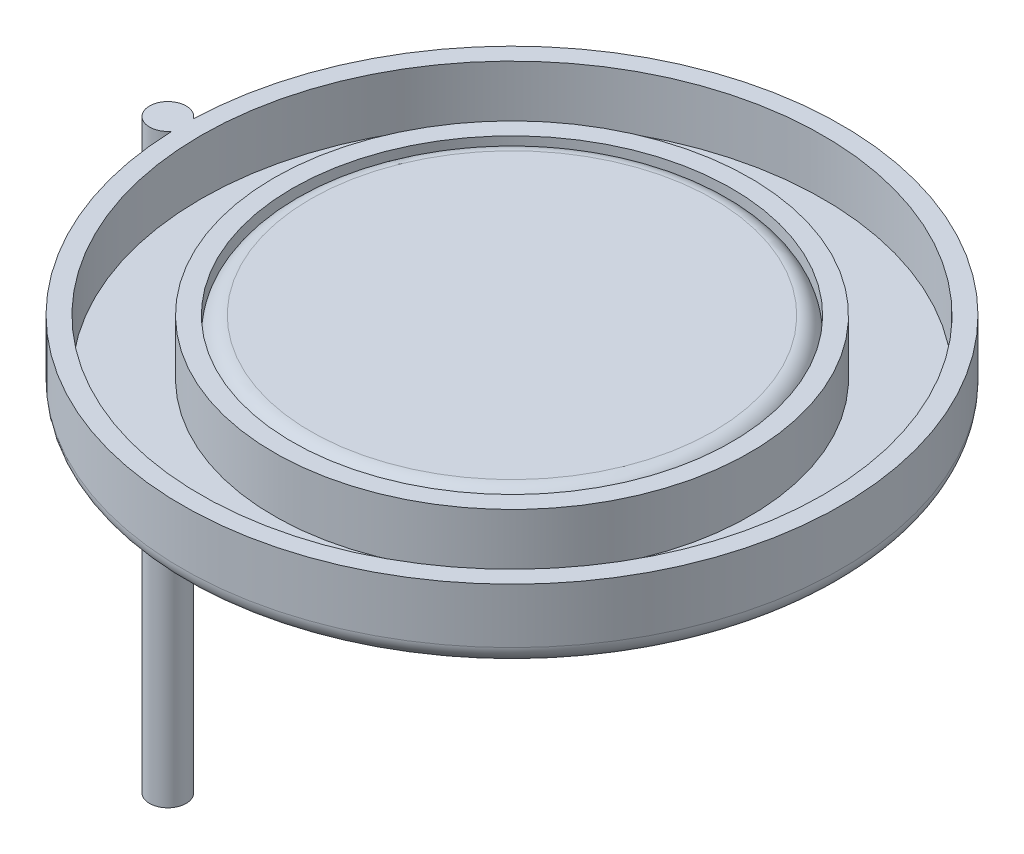
ISO-10303-21;
HEADER;
FILE_DESCRIPTION(('STEP AP214'),'2;1');
FILE_NAME('part.step','',(''),(''),'','','');
FILE_SCHEMA(('AUTOMOTIVE_DESIGN { 1 0 10303 214 1 1 1 1 }'));
ENDSEC;
DATA;
#1=APPLICATION_CONTEXT('core data for automotive mechanical design processes');
#2=APPLICATION_PROTOCOL_DEFINITION('international standard','automotive_design',2000,#1);
#3=PRODUCT_CONTEXT('',#1,'mechanical');
#4=PRODUCT('Part','Part','',(#3));
#5=PRODUCT_RELATED_PRODUCT_CATEGORY('part','',(#4));
#6=PRODUCT_DEFINITION_FORMATION('','',#4);
#7=PRODUCT_DEFINITION_CONTEXT('part definition',#1,'design');
#8=PRODUCT_DEFINITION('design','',#6,#7);
#9=PRODUCT_DEFINITION_SHAPE('','',#8);
#10=(LENGTH_UNIT() NAMED_UNIT(*) SI_UNIT(.MILLI.,.METRE.));
#11=(NAMED_UNIT(*) PLANE_ANGLE_UNIT() SI_UNIT($,.RADIAN.));
#12=(NAMED_UNIT(*) SI_UNIT($,.STERADIAN.) SOLID_ANGLE_UNIT());
#13=UNCERTAINTY_MEASURE_WITH_UNIT(LENGTH_MEASURE(1.E-05),#10,'distance_accuracy_value','');
#14=(GEOMETRIC_REPRESENTATION_CONTEXT(3) GLOBAL_UNCERTAINTY_ASSIGNED_CONTEXT((#13)) GLOBAL_UNIT_ASSIGNED_CONTEXT((#10,
#11,#12)) REPRESENTATION_CONTEXT('',''));
#15=CARTESIAN_POINT('',(0.,0.,0.));
#16=DIRECTION('',(0.,0.,1.));
#17=DIRECTION('',(1.,0.,0.));
#18=AXIS2_PLACEMENT_3D('',#15,#16,#17);
#19=CARTESIAN_POINT('',(0.,1.05,0.));
#20=DIRECTION('',(0.,1.,0.));
#21=DIRECTION('',(-1.,0.,0.));
#22=AXIS2_PLACEMENT_3D('',#19,#20,#21);
#23=CYLINDRICAL_SURFACE('',#22,3.);
#24=CARTESIAN_POINT('',(0.,0.999999999999999,0.));
#25=DIRECTION('',(0.,1.,0.));
#26=DIRECTION('',(-1.,0.,0.));
#27=AXIS2_PLACEMENT_3D('',#24,#25,#26);
#28=CIRCLE('',#27,3.);
#29=CARTESIAN_POINT('',(-3.,1.,0.));
#30=VERTEX_POINT('',#29);
#31=EDGE_CURVE('E94',#30,#30,#28,.T.);
#32=ORIENTED_EDGE('',*,*,#31,.T.);
#33=EDGE_LOOP('',(#32));
#34=FACE_BOUND('',#33,.T.);
#35=CARTESIAN_POINT('',(0.,0.75,0.));
#36=DIRECTION('',(0.,-1.,0.));
#37=DIRECTION('',(1.,0.,0.));
#38=AXIS2_PLACEMENT_3D('',#35,#36,#37);
#39=CIRCLE('',#38,3.);
#40=CARTESIAN_POINT('',(3.,0.75,0.));
#41=VERTEX_POINT('',#40);
#42=EDGE_CURVE('E286',#41,#41,#39,.T.);
#43=ORIENTED_EDGE('',*,*,#42,.T.);
#44=EDGE_LOOP('',(#43));
#45=FACE_BOUND('',#44,.T.);
#46=ADVANCED_FACE('F32',(#34,#45),#23,.F.);
#47=CARTESIAN_POINT('',(-4.7,-7.,0.));
#48=DIRECTION('',(0.,1.,0.));
#49=DIRECTION('',(-1.,0.,0.));
#50=AXIS2_PLACEMENT_3D('',#47,#48,#49);
#51=CYLINDRICAL_SURFACE('',#50,0.25);
#52=DIRECTION('',(0.,1.,0.));
#53=VECTOR('',#52,1.);
#54=CARTESIAN_POINT('',(-4.49760638297872,0.625,-0.146754297344388));
#55=LINE('',#54,#53);
#56=CARTESIAN_POINT('',(-4.49760638297872,0.25,-0.146754297344388));
#57=VERTEX_POINT('',#56);
#58=CARTESIAN_POINT('',(-4.49760638297872,1.,-0.146754297344388));
#59=VERTEX_POINT('',#58);
#60=EDGE_CURVE('E60',#57,#59,#55,.T.);
#61=ORIENTED_EDGE('',*,*,#60,.F.);
#62=CARTESIAN_POINT('',(-4.49760630638297,0.2502,0.146754191708636));
#63=CARTESIAN_POINT('',(-4.49762410202563,0.241930948862253,0.14675955146571));
#64=CARTESIAN_POINT('',(-4.49722663321649,0.233658933576919,0.146230014571357));
#65=CARTESIAN_POINT('',(-4.49568006883129,0.217319938522348,0.144071640543252));
#66=CARTESIAN_POINT('',(-4.4945299259303,0.20925326074727,0.142441271531871));
#67=CARTESIAN_POINT('',(-4.49155519513391,0.193549037815725,0.138048428377494));
#68=CARTESIAN_POINT('',(-4.48972964945597,0.185912119902879,0.135284345918194));
#69=CARTESIAN_POINT('',(-4.48557558234056,0.17131860765148,0.128598877003869));
#70=CARTESIAN_POINT('',(-4.48324759446005,0.164361302911009,0.124678716613543));
#71=CARTESIAN_POINT('',(-4.47836121673525,0.151439031337531,0.115764991181218));
#72=CARTESIAN_POINT('',(-4.47580705428886,0.145460107428513,0.110789387751526));
#73=CARTESIAN_POINT('',(-4.47070827083454,0.13452929133629,0.0998089268948837));
#74=CARTESIAN_POINT('',(-4.46816365017578,0.129577436386102,0.0938040321687606));
#75=CARTESIAN_POINT('',(-4.46346389959384,0.120993587018328,0.0812026545558668));
#76=CARTESIAN_POINT('',(-4.46129662962509,0.117313483948165,0.0746433498620404));
#77=CARTESIAN_POINT('',(-4.45742801217928,0.111013878055508,0.0609074878288262));
#78=CARTESIAN_POINT('',(-4.45572669984212,0.108394455216407,0.0537308839898221));
#79=CARTESIAN_POINT('',(-4.45293109441321,0.104194906463015,0.038912732145378));
#80=CARTESIAN_POINT('',(-4.4518410846646,0.10262210013598,0.0312683096341471));
#81=CARTESIAN_POINT('',(-4.45037636964013,0.10052585170435,0.0157693052565196));
#82=CARTESIAN_POINT('',(-4.45000181517096,0.100002630834661,0.00791467943629636));
#83=CARTESIAN_POINT('',(-4.44999814653398,0.0999973130742638,-0.00802356277860808));
#84=CARTESIAN_POINT('',(-4.4503909433348,0.10054581835986,-0.0161072205920081));
#85=CARTESIAN_POINT('',(-4.45193334731891,0.102755089900064,-0.0320476164276199));
#86=CARTESIAN_POINT('',(-4.45308293713906,0.104415830636637,-0.0399043596516228));
#87=CARTESIAN_POINT('',(-4.45603943680495,0.108872565523693,-0.0551701178883071));
#88=CARTESIAN_POINT('',(-4.45784706635036,0.111669803053877,-0.0625786322861057));
#89=CARTESIAN_POINT('',(-4.46194620752408,0.118405419197658,-0.0767106358352226));
#90=CARTESIAN_POINT('',(-4.46423758061989,0.122343471229411,-0.0834343202898465));
#91=CARTESIAN_POINT('',(-4.46899948883797,0.131193018337334,-0.0958207985261037));
#92=CARTESIAN_POINT('',(-4.47146308903941,0.136073696815364,-0.101508295451171));
#93=CARTESIAN_POINT('',(-4.47637623038614,0.146776635020957,-0.111917849220896));
#94=CARTESIAN_POINT('',(-4.47882577505019,0.152598647393039,-0.116640158952936));
#95=CARTESIAN_POINT('',(-4.48345089852349,0.16497871544306,-0.125017220482105));
#96=CARTESIAN_POINT('',(-4.48562866830138,0.171529952662846,-0.128680872244827));
#97=CARTESIAN_POINT('',(-4.48954349131381,0.185234033204647,-0.134988061985459));
#98=CARTESIAN_POINT('',(-4.49128009797401,0.192387476446871,-0.137630567690722));
#99=CARTESIAN_POINT('',(-4.49430906338326,0.207831493807149,-0.142126150227152));
#100=CARTESIAN_POINT('',(-4.49554022441958,0.216164462884364,-0.143874846815892));
#101=CARTESIAN_POINT('',(-4.49719870086938,0.23306664782491,-0.146191385241015));
#102=CARTESIAN_POINT('',(-4.49762646695095,0.241635728501194,-0.146759889130757));
#103=CARTESIAN_POINT('',(-4.49760630638297,0.250199999999983,-0.146754191708693));
#104=B_SPLINE_CURVE_WITH_KNOTS('',3,(#62,#63,#64,#65,#66,#67,#68,#69,#70,#71,#72,#73,#74,#75,
#76,#77,#78,#79,#80,#81,#82,#83,#84,#85,#86,#87,#88,#89,#90,#91,#92,#93,#94,#95,#96,#97,#98,#99,
#100,#101,#102,#103),.UNSPECIFIED.,.F.,.F.,(4,2,2,2,2,2,2,2,2,2,2,2,2,2,2,2,2,2,2,2,4),(0.,
0.0247836060695387,0.0496017713696941,0.074455266832717,0.0992824984286643,0.123716978920959,
0.148152345050434,0.171522989171247,0.194895395289112,0.218429586651436,0.241968738103186,
0.266189856028938,0.290410418268241,0.314657550576807,0.338897748487901,0.362449635329038,
0.385995343439517,0.40933692915298,0.432702049442135,0.458386144744586,0.484055828128045),.UNSPECIFIED.);
#105=CARTESIAN_POINT('',(-4.49760638297872,0.25,0.146754297344444));
#106=VERTEX_POINT('',#105);
#107=EDGE_CURVE('E11',#106,#57,#104,.T.);
#108=ORIENTED_EDGE('',*,*,#107,.F.);
#109=DIRECTION('',(0.,1.,0.));
#110=VECTOR('',#109,1.);
#111=CARTESIAN_POINT('',(-4.49760638297872,0.625,0.146754297344388));
#112=LINE('',#111,#110);
#113=CARTESIAN_POINT('',(-4.49760638297872,1.,0.146754297344388));
#114=VERTEX_POINT('',#113);
#115=EDGE_CURVE('E66',#114,#106,#112,.F.);
#116=ORIENTED_EDGE('',*,*,#115,.F.);
#117=CARTESIAN_POINT('',(-4.7,1.,0.));
#118=DIRECTION('',(0.,1.,0.));
#119=DIRECTION('',(-1.,0.,0.));
#120=AXIS2_PLACEMENT_3D('',#117,#118,#119);
#121=CIRCLE('',#120,0.25);
#122=EDGE_CURVE('E55',#59,#114,#121,.T.);
#123=ORIENTED_EDGE('',*,*,#122,.F.);
#124=EDGE_LOOP('',(#61,#108,#116,#123));
#125=FACE_BOUND('',#124,.T.);
#126=CARTESIAN_POINT('',(-4.7,-7.,0.));
#127=DIRECTION('',(0.,1.,0.));
#128=DIRECTION('',(-1.,0.,0.));
#129=AXIS2_PLACEMENT_3D('',#126,#127,#128);
#130=CIRCLE('',#129,0.25);
#131=CARTESIAN_POINT('',(-4.95,-7.,0.));
#132=VERTEX_POINT('',#131);
#133=EDGE_CURVE('E45',#132,#132,#130,.T.);
#134=ORIENTED_EDGE('',*,*,#133,.T.);
#135=EDGE_LOOP('',(#134));
#136=FACE_BOUND('',#135,.T.);
#137=ADVANCED_FACE('F34',(#125,#136),#51,.T.);
#138=CARTESIAN_POINT('',(-4.7,-7.,0.));
#139=DIRECTION('',(0.,1.,0.));
#140=DIRECTION('',(-1.,0.,0.));
#141=AXIS2_PLACEMENT_3D('',#138,#139,#140);
#142=PLANE('',#141);
#143=ORIENTED_EDGE('',*,*,#133,.F.);
#144=EDGE_LOOP('',(#143));
#145=FACE_BOUND('',#144,.T.);
#146=ADVANCED_FACE('F104',(#145),#142,.F.);
#147=CARTESIAN_POINT('',(-4.7,1.,0.));
#148=DIRECTION('',(0.,1.,0.));
#149=DIRECTION('',(-1.,0.,0.));
#150=AXIS2_PLACEMENT_3D('',#147,#148,#149);
#151=PLANE('',#150);
#152=ORIENTED_EDGE('',*,*,#122,.T.);
#153=CARTESIAN_POINT('',(0.,0.999999999999999,0.));
#154=DIRECTION('',(0.,1.,0.));
#155=DIRECTION('',(-1.,0.,0.));
#156=AXIS2_PLACEMENT_3D('',#153,#154,#155);
#157=CIRCLE('',#156,4.5);
#158=EDGE_CURVE('E73',#114,#59,#157,.T.);
#159=ORIENTED_EDGE('',*,*,#158,.T.);
#160=EDGE_LOOP('',(#152,#159));
#161=FACE_BOUND('',#160,.T.);
#162=CARTESIAN_POINT('',(0.,0.999999999999999,0.));
#163=DIRECTION('',(0.,1.,0.));
#164=DIRECTION('',(-1.,0.,0.));
#165=AXIS2_PLACEMENT_3D('',#162,#163,#164);
#166=CIRCLE('',#165,4.25);
#167=CARTESIAN_POINT('',(-4.25,1.,0.));
#168=VERTEX_POINT('',#167);
#169=EDGE_CURVE('E76',#168,#168,#166,.T.);
#170=ORIENTED_EDGE('',*,*,#169,.F.);
#171=EDGE_LOOP('',(#170));
#172=FACE_BOUND('',#171,.T.);
#173=ADVANCED_FACE('F100',(#161,#172),#151,.T.);
#174=CARTESIAN_POINT('',(-3.25,1.,0.));
#175=DIRECTION('',(0.,-1.,0.));
#176=DIRECTION('',(1.,0.,0.));
#177=AXIS2_PLACEMENT_3D('',#174,#175,#176);
#178=PLANE('',#177);
#179=ORIENTED_EDGE('',*,*,#31,.F.);
#180=EDGE_LOOP('',(#179));
#181=FACE_BOUND('',#180,.T.);
#182=CARTESIAN_POINT('',(0.,0.999999999999999,0.));
#183=DIRECTION('',(0.,1.,0.));
#184=DIRECTION('',(-1.,0.,0.));
#185=AXIS2_PLACEMENT_3D('',#182,#183,#184);
#186=CIRCLE('',#185,3.25);
#187=CARTESIAN_POINT('',(-3.25,1.,0.));
#188=VERTEX_POINT('',#187);
#189=EDGE_CURVE('E91',#188,#188,#186,.T.);
#190=ORIENTED_EDGE('',*,*,#189,.T.);
#191=EDGE_LOOP('',(#190));
#192=FACE_BOUND('',#191,.T.);
#193=ADVANCED_FACE('F103',(#181,#192),#178,.F.);
#194=CARTESIAN_POINT('',(0.,1.05,0.));
#195=DIRECTION('',(0.,1.,0.));
#196=DIRECTION('',(-1.,0.,0.));
#197=AXIS2_PLACEMENT_3D('',#194,#195,#196);
#198=CYLINDRICAL_SURFACE('',#197,3.25);
#199=ORIENTED_EDGE('',*,*,#189,.F.);
#200=EDGE_LOOP('',(#199));
#201=FACE_BOUND('',#200,.T.);
#202=CARTESIAN_POINT('',(0.,0.249999999999999,0.));
#203=DIRECTION('',(0.,1.,0.));
#204=DIRECTION('',(-1.,0.,0.));
#205=AXIS2_PLACEMENT_3D('',#202,#203,#204);
#206=CIRCLE('',#205,3.25);
#207=CARTESIAN_POINT('',(-3.25,0.25,0.));
#208=VERTEX_POINT('',#207);
#209=EDGE_CURVE('E88',#208,#208,#206,.T.);
#210=ORIENTED_EDGE('',*,*,#209,.T.);
#211=EDGE_LOOP('',(#210));
#212=FACE_BOUND('',#211,.T.);
#213=ADVANCED_FACE('F117',(#201,#212),#198,.T.);
#214=CARTESIAN_POINT('',(-4.25,0.25,0.));
#215=DIRECTION('',(0.,-1.,0.));
#216=DIRECTION('',(1.,0.,0.));
#217=AXIS2_PLACEMENT_3D('',#214,#215,#216);
#218=PLANE('',#217);
#219=ORIENTED_EDGE('',*,*,#209,.F.);
#220=EDGE_LOOP('',(#219));
#221=FACE_BOUND('',#220,.T.);
#222=CARTESIAN_POINT('',(0.,0.249999999999999,0.));
#223=DIRECTION('',(0.,1.,0.));
#224=DIRECTION('',(-1.,0.,0.));
#225=AXIS2_PLACEMENT_3D('',#222,#223,#224);
#226=CIRCLE('',#225,4.25);
#227=CARTESIAN_POINT('',(-4.25,0.25,0.));
#228=VERTEX_POINT('',#227);
#229=EDGE_CURVE('E85',#228,#228,#226,.T.);
#230=ORIENTED_EDGE('',*,*,#229,.T.);
#231=EDGE_LOOP('',(#230));
#232=FACE_BOUND('',#231,.T.);
#233=ADVANCED_FACE('F109',(#221,#232),#218,.F.);
#234=CARTESIAN_POINT('',(0.,1.05,0.));
#235=DIRECTION('',(0.,1.,0.));
#236=DIRECTION('',(-1.,0.,0.));
#237=AXIS2_PLACEMENT_3D('',#234,#235,#236);
#238=CYLINDRICAL_SURFACE('',#237,4.25);
#239=ORIENTED_EDGE('',*,*,#229,.F.);
#240=EDGE_LOOP('',(#239));
#241=FACE_BOUND('',#240,.T.);
#242=ORIENTED_EDGE('',*,*,#169,.T.);
#243=EDGE_LOOP('',(#242));
#244=FACE_BOUND('',#243,.T.);
#245=ADVANCED_FACE('F107',(#241,#244),#238,.F.);
#246=CARTESIAN_POINT('',(0.,1.05,0.));
#247=DIRECTION('',(0.,1.,0.));
#248=DIRECTION('',(-1.,0.,0.));
#249=AXIS2_PLACEMENT_3D('',#246,#247,#248);
#250=CYLINDRICAL_SURFACE('',#249,4.5);
#251=CARTESIAN_POINT('',(0.,0.249999999999999,0.));
#252=DIRECTION('',(0.,1.,0.));
#253=DIRECTION('',(-1.,0.,0.));
#254=AXIS2_PLACEMENT_3D('',#251,#252,#253);
#255=CIRCLE('',#254,4.5);
#256=EDGE_CURVE('E71',#106,#57,#255,.T.);
#257=ORIENTED_EDGE('',*,*,#256,.T.);
#258=ORIENTED_EDGE('',*,*,#60,.T.);
#259=ORIENTED_EDGE('',*,*,#158,.F.);
#260=ORIENTED_EDGE('',*,*,#115,.T.);
#261=EDGE_LOOP('',(#257,#258,#259,#260));
#262=FACE_BOUND('',#261,.T.);
#263=ADVANCED_FACE('F72',(#262),#250,.T.);
#264=CARTESIAN_POINT('',(0.,0.249999999999999,0.));
#265=DIRECTION('',(0.,1.,0.));
#266=DIRECTION('',(-1.,0.,0.));
#267=AXIS2_PLACEMENT_3D('',#264,#265,#266);
#268=TOROIDAL_SURFACE('',#267,4.25,0.25);
#269=CARTESIAN_POINT('',(0.,0.,0.));
#270=DIRECTION('',(0.,1.,0.));
#271=DIRECTION('',(-1.,0.,0.));
#272=AXIS2_PLACEMENT_3D('',#269,#270,#271);
#273=CIRCLE('',#272,4.25);
#274=CARTESIAN_POINT('',(-4.25,0.,0.));
#275=VERTEX_POINT('',#274);
#276=EDGE_CURVE('E74',#275,#275,#273,.T.);
#277=ORIENTED_EDGE('',*,*,#276,.T.);
#278=EDGE_LOOP('',(#277));
#279=FACE_BOUND('',#278,.T.);
#280=ORIENTED_EDGE('',*,*,#256,.F.);
#281=ORIENTED_EDGE('',*,*,#107,.T.);
#282=EDGE_LOOP('',(#280,#281));
#283=FACE_BOUND('',#282,.T.);
#284=ADVANCED_FACE('F70',(#279,#283),#268,.T.);
#285=CARTESIAN_POINT('',(-4.25,0.,0.));
#286=DIRECTION('',(0.,-1.,0.));
#287=DIRECTION('',(1.,0.,0.));
#288=AXIS2_PLACEMENT_3D('',#285,#286,#287);
#289=PLANE('',#288);
#290=CARTESIAN_POINT('',(0.,0.,0.));
#291=DIRECTION('',(0.,1.,0.));
#292=DIRECTION('',(-1.,0.,0.));
#293=AXIS2_PLACEMENT_3D('',#290,#291,#292);
#294=CIRCLE('',#293,3.25);
#295=CARTESIAN_POINT('',(-3.25,0.,0.));
#296=VERTEX_POINT('',#295);
#297=EDGE_CURVE('E79',#296,#296,#294,.T.);
#298=ORIENTED_EDGE('',*,*,#297,.T.);
#299=EDGE_LOOP('',(#298));
#300=FACE_BOUND('',#299,.T.);
#301=ORIENTED_EDGE('',*,*,#276,.F.);
#302=EDGE_LOOP('',(#301));
#303=FACE_BOUND('',#302,.T.);
#304=ADVANCED_FACE('F177',(#300,#303),#289,.T.);
#305=CARTESIAN_POINT('',(0.,0.249999999999999,0.));
#306=DIRECTION('',(0.,1.,0.));
#307=DIRECTION('',(-1.,0.,0.));
#308=AXIS2_PLACEMENT_3D('',#305,#306,#307);
#309=TOROIDAL_SURFACE('',#308,3.25,0.25);
#310=CARTESIAN_POINT('',(0.,0.249999999999999,0.));
#311=DIRECTION('',(0.,-1.,0.));
#312=DIRECTION('',(1.,0.,0.));
#313=AXIS2_PLACEMENT_3D('',#310,#311,#312);
#314=CIRCLE('',#313,3.);
#315=CARTESIAN_POINT('',(3.,0.249999999999999,0.));
#316=VERTEX_POINT('',#315);
#317=EDGE_CURVE('E299',#316,#316,#314,.F.);
#318=ORIENTED_EDGE('',*,*,#317,.T.);
#319=EDGE_LOOP('',(#318));
#320=FACE_BOUND('',#319,.T.);
#321=ORIENTED_EDGE('',*,*,#297,.F.);
#322=EDGE_LOOP('',(#321));
#323=FACE_BOUND('',#322,.T.);
#324=ADVANCED_FACE('F186',(#320,#323),#309,.T.);
#325=CARTESIAN_POINT('',(3.,0.,0.));
#326=DIRECTION('',(0.,1.,0.));
#327=DIRECTION('',(-1.,0.,0.));
#328=AXIS2_PLACEMENT_3D('',#325,#326,#327);
#329=PLANE('',#328);
#330=CARTESIAN_POINT('',(0.,0.,0.));
#331=DIRECTION('',(0.,-1.,0.));
#332=DIRECTION('',(1.,0.,0.));
#333=AXIS2_PLACEMENT_3D('',#330,#331,#332);
#334=CIRCLE('',#333,2.75);
#335=CARTESIAN_POINT('',(2.75,0.,0.));
#336=VERTEX_POINT('',#335);
#337=EDGE_CURVE('E290',#336,#336,#334,.T.);
#338=ORIENTED_EDGE('',*,*,#337,.F.);
#339=EDGE_LOOP('',(#338));
#340=FACE_BOUND('',#339,.T.);
#341=CARTESIAN_POINT('',(0.,0.,0.));
#342=DIRECTION('',(0.,-1.,0.));
#343=DIRECTION('',(1.,0.,0.));
#344=AXIS2_PLACEMENT_3D('',#341,#342,#343);
#345=CIRCLE('',#344,3.);
#346=CARTESIAN_POINT('',(3.,0.,0.));
#347=VERTEX_POINT('',#346);
#348=EDGE_CURVE('E287',#347,#347,#345,.T.);
#349=ORIENTED_EDGE('',*,*,#348,.T.);
#350=EDGE_LOOP('',(#349));
#351=FACE_BOUND('',#350,.T.);
#352=ADVANCED_FACE('F196',(#340,#351),#329,.F.);
#353=CARTESIAN_POINT('',(0.,-0.05,0.));
#354=DIRECTION('',(0.,-1.,0.));
#355=DIRECTION('',(1.,0.,0.));
#356=AXIS2_PLACEMENT_3D('',#353,#354,#355);
#357=CYLINDRICAL_SURFACE('',#356,2.75);
#358=CARTESIAN_POINT('',(0.,0.75,0.));
#359=DIRECTION('',(0.,-1.,0.));
#360=DIRECTION('',(1.,0.,0.));
#361=AXIS2_PLACEMENT_3D('',#358,#359,#360);
#362=CIRCLE('',#361,2.75);
#363=CARTESIAN_POINT('',(2.75,0.75,0.));
#364=VERTEX_POINT('',#363);
#365=EDGE_CURVE('E296',#364,#364,#362,.T.);
#366=ORIENTED_EDGE('',*,*,#365,.F.);
#367=EDGE_LOOP('',(#366));
#368=FACE_BOUND('',#367,.T.);
#369=ORIENTED_EDGE('',*,*,#337,.T.);
#370=EDGE_LOOP('',(#369));
#371=FACE_BOUND('',#370,.T.);
#372=ADVANCED_FACE('F206',(#368,#371),#357,.F.);
#373=CARTESIAN_POINT('',(2.75,0.75,0.));
#374=DIRECTION('',(0.,1.,0.));
#375=DIRECTION('',(-1.,0.,0.));
#376=AXIS2_PLACEMENT_3D('',#373,#374,#375);
#377=PLANE('',#376);
#378=ORIENTED_EDGE('',*,*,#365,.T.);
#379=EDGE_LOOP('',(#378));
#380=FACE_BOUND('',#379,.T.);
#381=ADVANCED_FACE('F217',(#380),#377,.F.);
#382=CARTESIAN_POINT('',(0.,-0.05,0.));
#383=DIRECTION('',(0.,-1.,0.));
#384=DIRECTION('',(1.,0.,0.));
#385=AXIS2_PLACEMENT_3D('',#382,#383,#384);
#386=CYLINDRICAL_SURFACE('',#385,3.);
#387=ORIENTED_EDGE('',*,*,#348,.F.);
#388=EDGE_LOOP('',(#387));
#389=FACE_BOUND('',#388,.T.);
#390=ORIENTED_EDGE('',*,*,#317,.F.);
#391=EDGE_LOOP('',(#390));
#392=FACE_BOUND('',#391,.T.);
#393=ADVANCED_FACE('F227',(#389,#392),#386,.T.);
#394=CARTESIAN_POINT('',(2.75,1.,0.));
#395=DIRECTION('',(0.,1.,0.));
#396=DIRECTION('',(-1.,0.,0.));
#397=AXIS2_PLACEMENT_3D('',#394,#395,#396);
#398=PLANE('',#397);
#399=CARTESIAN_POINT('',(0.,1.,0.));
#400=DIRECTION('',(0.,-1.,0.));
#401=DIRECTION('',(1.,0.,0.));
#402=AXIS2_PLACEMENT_3D('',#399,#400,#401);
#403=CIRCLE('',#402,2.75);
#404=CARTESIAN_POINT('',(2.75,1.,0.));
#405=VERTEX_POINT('',#404);
#406=EDGE_CURVE('E283',#405,#405,#403,.T.);
#407=ORIENTED_EDGE('',*,*,#406,.F.);
#408=EDGE_LOOP('',(#407));
#409=FACE_BOUND('',#408,.T.);
#410=ADVANCED_FACE('F238',(#409),#398,.T.);
#411=CARTESIAN_POINT('',(0.,0.75,0.));
#412=DIRECTION('',(0.,-1.,0.));
#413=DIRECTION('',(1.,0.,0.));
#414=AXIS2_PLACEMENT_3D('',#411,#412,#413);
#415=TOROIDAL_SURFACE('',#414,2.75,0.25);
#416=ORIENTED_EDGE('',*,*,#406,.T.);
#417=EDGE_LOOP('',(#416));
#418=FACE_BOUND('',#417,.T.);
#419=ORIENTED_EDGE('',*,*,#42,.F.);
#420=EDGE_LOOP('',(#419));
#421=FACE_BOUND('',#420,.T.);
#422=ADVANCED_FACE('F248',(#418,#421),#415,.T.);
#423=CLOSED_SHELL('',(#46,#137,#146,#173,#193,#213,#233,#245,#263,#284,#304,#324,#352,#372,#381,
#393,#410,#422));
#424=MANIFOLD_SOLID_BREP('B2',#423);
#425=ADVANCED_BREP_SHAPE_REPRESENTATION('',(#18,#424),#14);
#426=SHAPE_DEFINITION_REPRESENTATION(#9,#425);
ENDSEC;
END-ISO-10303-21;
